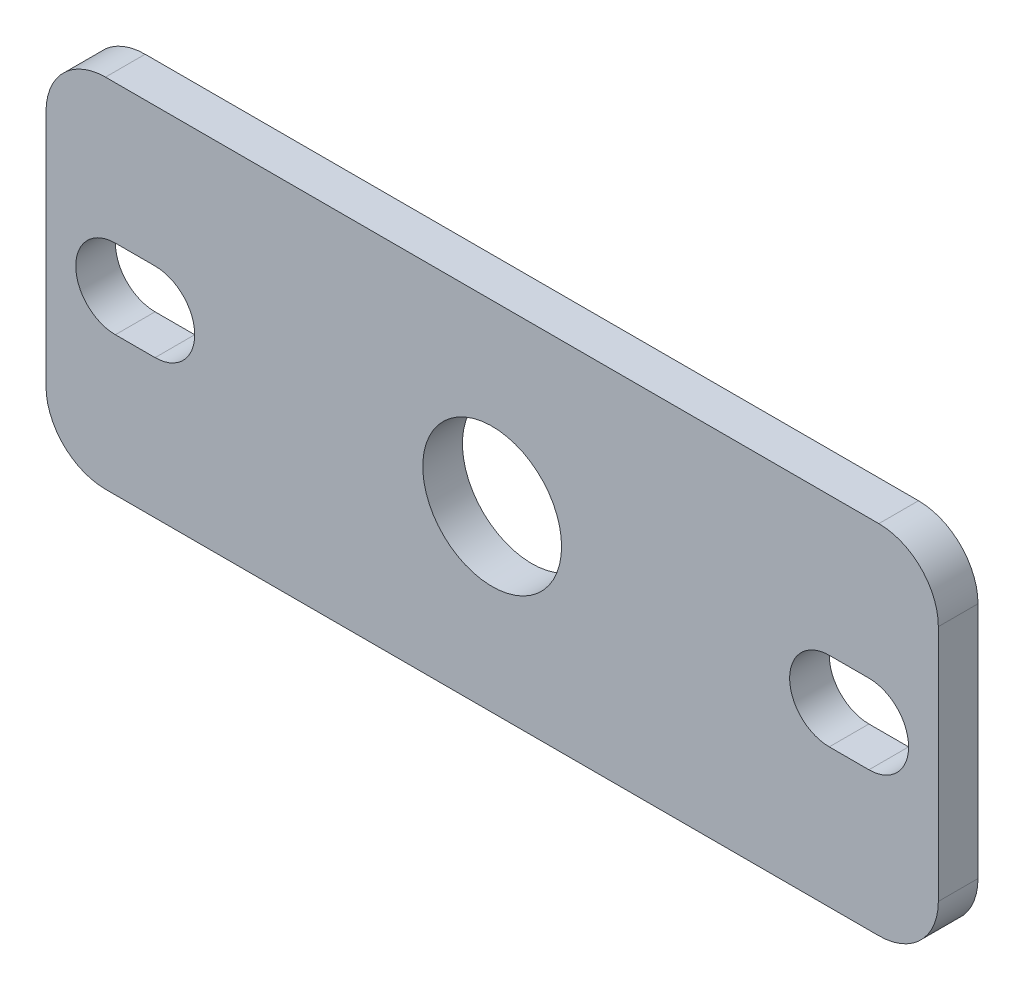
ISO-10303-21;
HEADER;
FILE_DESCRIPTION(('STEP AP214'),'2;1');
FILE_NAME('part.step','',(''),(''),'','','');
FILE_SCHEMA(('AUTOMOTIVE_DESIGN { 1 0 10303 214 1 1 1 1 }'));
ENDSEC;
DATA;
#1=APPLICATION_CONTEXT('core data for automotive mechanical design processes');
#2=APPLICATION_PROTOCOL_DEFINITION('international standard','automotive_design',2000,#1);
#3=PRODUCT_CONTEXT('',#1,'mechanical');
#4=PRODUCT('Part','Part','',(#3));
#5=PRODUCT_RELATED_PRODUCT_CATEGORY('part','',(#4));
#6=PRODUCT_DEFINITION_FORMATION('','',#4);
#7=PRODUCT_DEFINITION_CONTEXT('part definition',#1,'design');
#8=PRODUCT_DEFINITION('design','',#6,#7);
#9=PRODUCT_DEFINITION_SHAPE('','',#8);
#10=(LENGTH_UNIT() NAMED_UNIT(*) SI_UNIT(.MILLI.,.METRE.));
#11=(NAMED_UNIT(*) PLANE_ANGLE_UNIT() SI_UNIT($,.RADIAN.));
#12=(NAMED_UNIT(*) SI_UNIT($,.STERADIAN.) SOLID_ANGLE_UNIT());
#13=UNCERTAINTY_MEASURE_WITH_UNIT(LENGTH_MEASURE(1.E-05),#10,'distance_accuracy_value','');
#14=(GEOMETRIC_REPRESENTATION_CONTEXT(3) GLOBAL_UNCERTAINTY_ASSIGNED_CONTEXT((#13)) GLOBAL_UNIT_ASSIGNED_CONTEXT((#10,
#11,#12)) REPRESENTATION_CONTEXT('',''));
#15=CARTESIAN_POINT('',(0.,0.,0.));
#16=DIRECTION('',(0.,0.,1.));
#17=DIRECTION('',(1.,0.,0.));
#18=AXIS2_PLACEMENT_3D('',#15,#16,#17);
#19=CARTESIAN_POINT('',(-22.5,9.,2.));
#20=DIRECTION('',(1.,0.,0.));
#21=DIRECTION('',(0.,0.,-1.));
#22=AXIS2_PLACEMENT_3D('',#19,#20,#21);
#23=PLANE('',#22);
#24=DIRECTION('',(0.,-1.,0.));
#25=VECTOR('',#24,1.);
#26=CARTESIAN_POINT('',(-22.5,9.,0.));
#27=LINE('',#26,#25);
#28=CARTESIAN_POINT('',(-22.5,6.,0.));
#29=VERTEX_POINT('',#28);
#30=CARTESIAN_POINT('',(-22.5,-6.,0.));
#31=VERTEX_POINT('',#30);
#32=EDGE_CURVE('E214',#29,#31,#27,.T.);
#33=ORIENTED_EDGE('',*,*,#32,.T.);
#34=DIRECTION('',(0.,0.,-1.));
#35=VECTOR('',#34,1.);
#36=CARTESIAN_POINT('',(-22.5,-6.,2.));
#37=LINE('',#36,#35);
#38=CARTESIAN_POINT('',(-22.5,-6.,2.));
#39=VERTEX_POINT('',#38);
#40=EDGE_CURVE('E267',#31,#39,#37,.F.);
#41=ORIENTED_EDGE('',*,*,#40,.T.);
#42=DIRECTION('',(0.,-1.,0.));
#43=VECTOR('',#42,1.);
#44=CARTESIAN_POINT('',(-22.5,9.,2.));
#45=LINE('',#44,#43);
#46=CARTESIAN_POINT('',(-22.5,6.,2.));
#47=VERTEX_POINT('',#46);
#48=EDGE_CURVE('E215',#47,#39,#45,.T.);
#49=ORIENTED_EDGE('',*,*,#48,.F.);
#50=DIRECTION('',(0.,0.,-1.));
#51=VECTOR('',#50,1.);
#52=CARTESIAN_POINT('',(-22.5,6.,2.));
#53=LINE('',#52,#51);
#54=EDGE_CURVE('E264',#47,#29,#53,.T.);
#55=ORIENTED_EDGE('',*,*,#54,.T.);
#56=EDGE_LOOP('',(#33,#41,#49,#55));
#57=FACE_BOUND('',#56,.T.);
#58=ADVANCED_FACE('F34',(#57),#23,.F.);
#59=CARTESIAN_POINT('',(-22.5,-9.,2.));
#60=DIRECTION('',(0.,1.,0.));
#61=DIRECTION('',(0.,0.,1.));
#62=AXIS2_PLACEMENT_3D('',#59,#60,#61);
#63=PLANE('',#62);
#64=DIRECTION('',(1.,0.,0.));
#65=VECTOR('',#64,1.);
#66=CARTESIAN_POINT('',(-22.5,-9.,0.));
#67=LINE('',#66,#65);
#68=CARTESIAN_POINT('',(-19.5,-9.,0.));
#69=VERTEX_POINT('',#68);
#70=CARTESIAN_POINT('',(19.5,-9.,0.));
#71=VERTEX_POINT('',#70);
#72=EDGE_CURVE('E231',#69,#71,#67,.T.);
#73=ORIENTED_EDGE('',*,*,#72,.T.);
#74=DIRECTION('',(0.,0.,-1.));
#75=VECTOR('',#74,1.);
#76=CARTESIAN_POINT('',(19.5,-9.,2.));
#77=LINE('',#76,#75);
#78=CARTESIAN_POINT('',(19.5,-9.,2.));
#79=VERTEX_POINT('',#78);
#80=EDGE_CURVE('E254',#71,#79,#77,.F.);
#81=ORIENTED_EDGE('',*,*,#80,.T.);
#82=DIRECTION('',(1.,0.,0.));
#83=VECTOR('',#82,1.);
#84=CARTESIAN_POINT('',(-22.5,-9.,2.));
#85=LINE('',#84,#83);
#86=CARTESIAN_POINT('',(-19.5,-9.,2.));
#87=VERTEX_POINT('',#86);
#88=EDGE_CURVE('E218',#87,#79,#85,.T.);
#89=ORIENTED_EDGE('',*,*,#88,.F.);
#90=DIRECTION('',(0.,0.,-1.));
#91=VECTOR('',#90,1.);
#92=CARTESIAN_POINT('',(-19.5,-9.,2.));
#93=LINE('',#92,#91);
#94=EDGE_CURVE('E251',#87,#69,#93,.T.);
#95=ORIENTED_EDGE('',*,*,#94,.T.);
#96=EDGE_LOOP('',(#73,#81,#89,#95));
#97=FACE_BOUND('',#96,.T.);
#98=ADVANCED_FACE('F293',(#97),#63,.F.);
#99=CARTESIAN_POINT('',(22.5,9.,2.));
#100=DIRECTION('',(-1.,0.,0.));
#101=DIRECTION('',(0.,0.,1.));
#102=AXIS2_PLACEMENT_3D('',#99,#100,#101);
#103=PLANE('',#102);
#104=DIRECTION('',(0.,1.,0.));
#105=VECTOR('',#104,1.);
#106=CARTESIAN_POINT('',(22.5,9.,2.));
#107=LINE('',#106,#105);
#108=CARTESIAN_POINT('',(22.5,-6.,2.));
#109=VERTEX_POINT('',#108);
#110=CARTESIAN_POINT('',(22.5,6.,2.));
#111=VERTEX_POINT('',#110);
#112=EDGE_CURVE('E222',#109,#111,#107,.T.);
#113=ORIENTED_EDGE('',*,*,#112,.F.);
#114=DIRECTION('',(0.,0.,-1.));
#115=VECTOR('',#114,1.);
#116=CARTESIAN_POINT('',(22.5,-6.,2.));
#117=LINE('',#116,#115);
#118=CARTESIAN_POINT('',(22.5,-6.,0.));
#119=VERTEX_POINT('',#118);
#120=EDGE_CURVE('E240',#109,#119,#117,.T.);
#121=ORIENTED_EDGE('',*,*,#120,.T.);
#122=DIRECTION('',(0.,1.,0.));
#123=VECTOR('',#122,1.);
#124=CARTESIAN_POINT('',(22.5,9.,0.));
#125=LINE('',#124,#123);
#126=CARTESIAN_POINT('',(22.5,6.,0.));
#127=VERTEX_POINT('',#126);
#128=EDGE_CURVE('E234',#119,#127,#125,.T.);
#129=ORIENTED_EDGE('',*,*,#128,.T.);
#130=DIRECTION('',(0.,0.,-1.));
#131=VECTOR('',#130,1.);
#132=CARTESIAN_POINT('',(22.5,6.,2.));
#133=LINE('',#132,#131);
#134=EDGE_CURVE('E228',#127,#111,#133,.F.);
#135=ORIENTED_EDGE('',*,*,#134,.T.);
#136=EDGE_LOOP('',(#113,#121,#129,#135));
#137=FACE_BOUND('',#136,.T.);
#138=ADVANCED_FACE('F301',(#137),#103,.F.);
#139=CARTESIAN_POINT('',(-22.5,9.,2.));
#140=DIRECTION('',(0.,-1.,0.));
#141=DIRECTION('',(0.,0.,-1.));
#142=AXIS2_PLACEMENT_3D('',#139,#140,#141);
#143=PLANE('',#142);
#144=DIRECTION('',(-1.,0.,0.));
#145=VECTOR('',#144,1.);
#146=CARTESIAN_POINT('',(-22.5,9.,2.));
#147=LINE('',#146,#145);
#148=CARTESIAN_POINT('',(19.5,9.,2.));
#149=VERTEX_POINT('',#148);
#150=CARTESIAN_POINT('',(-19.5,9.,2.));
#151=VERTEX_POINT('',#150);
#152=EDGE_CURVE('E225',#149,#151,#147,.T.);
#153=ORIENTED_EDGE('',*,*,#152,.F.);
#154=DIRECTION('',(0.,0.,-1.));
#155=VECTOR('',#154,1.);
#156=CARTESIAN_POINT('',(19.5,9.,2.));
#157=LINE('',#156,#155);
#158=CARTESIAN_POINT('',(19.5,9.,0.));
#159=VERTEX_POINT('',#158);
#160=EDGE_CURVE('E11',#149,#159,#157,.T.);
#161=ORIENTED_EDGE('',*,*,#160,.T.);
#162=DIRECTION('',(-1.,0.,0.));
#163=VECTOR('',#162,1.);
#164=CARTESIAN_POINT('',(-22.5,9.,0.));
#165=LINE('',#164,#163);
#166=CARTESIAN_POINT('',(-19.5,9.,0.));
#167=VERTEX_POINT('',#166);
#168=EDGE_CURVE('E219',#159,#167,#165,.T.);
#169=ORIENTED_EDGE('',*,*,#168,.T.);
#170=DIRECTION('',(0.,0.,-1.));
#171=VECTOR('',#170,1.);
#172=CARTESIAN_POINT('',(-19.5,9.,2.));
#173=LINE('',#172,#171);
#174=EDGE_CURVE('E42',#167,#151,#173,.F.);
#175=ORIENTED_EDGE('',*,*,#174,.T.);
#176=EDGE_LOOP('',(#153,#161,#169,#175));
#177=FACE_BOUND('',#176,.T.);
#178=ADVANCED_FACE('F271',(#177),#143,.F.);
#179=CARTESIAN_POINT('',(-22.5,-9.,2.));
#180=DIRECTION('',(0.,0.,1.));
#181=DIRECTION('',(1.,0.,0.));
#182=AXIS2_PLACEMENT_3D('',#179,#180,#181);
#183=PLANE('',#182);
#184=CARTESIAN_POINT('',(0.,0.,2.));
#185=DIRECTION('',(0.,0.,1.));
#186=DIRECTION('',(1.,0.,0.));
#187=AXIS2_PLACEMENT_3D('',#184,#185,#186);
#188=CIRCLE('',#187,3.5);
#189=CARTESIAN_POINT('',(3.5,0.,2.));
#190=VERTEX_POINT('',#189);
#191=EDGE_CURVE('E479',#190,#190,#188,.T.);
#192=ORIENTED_EDGE('',*,*,#191,.F.);
#193=EDGE_LOOP('',(#192));
#194=FACE_BOUND('',#193,.T.);
#195=CARTESIAN_POINT('',(-17.,0.,2.));
#196=DIRECTION('',(0.,0.,1.));
#197=DIRECTION('',(1.,0.,0.));
#198=AXIS2_PLACEMENT_3D('',#195,#196,#197);
#199=CIRCLE('',#198,2.);
#200=CARTESIAN_POINT('',(-17.,-2.,2.));
#201=VERTEX_POINT('',#200);
#202=CARTESIAN_POINT('',(-17.,2.,2.));
#203=VERTEX_POINT('',#202);
#204=EDGE_CURVE('E49',#201,#203,#199,.T.);
#205=ORIENTED_EDGE('',*,*,#204,.F.);
#206=DIRECTION('',(1.,0.,0.));
#207=VECTOR('',#206,1.);
#208=CARTESIAN_POINT('',(-19.,-2.,2.));
#209=LINE('',#208,#207);
#210=CARTESIAN_POINT('',(-19.,-2.,2.));
#211=VERTEX_POINT('',#210);
#212=EDGE_CURVE('E155',#211,#201,#209,.T.);
#213=ORIENTED_EDGE('',*,*,#212,.F.);
#214=CARTESIAN_POINT('',(-19.,0.,2.));
#215=DIRECTION('',(0.,0.,1.));
#216=DIRECTION('',(-1.,0.,0.));
#217=AXIS2_PLACEMENT_3D('',#214,#215,#216);
#218=CIRCLE('',#217,2.);
#219=CARTESIAN_POINT('',(-19.,2.,2.));
#220=VERTEX_POINT('',#219);
#221=EDGE_CURVE('E175',#220,#211,#218,.T.);
#222=ORIENTED_EDGE('',*,*,#221,.F.);
#223=DIRECTION('',(-1.,0.,0.));
#224=VECTOR('',#223,1.);
#225=CARTESIAN_POINT('',(-17.,2.,2.));
#226=LINE('',#225,#224);
#227=EDGE_CURVE('E169',#203,#220,#226,.T.);
#228=ORIENTED_EDGE('',*,*,#227,.F.);
#229=EDGE_LOOP('',(#205,#213,#222,#228));
#230=FACE_BOUND('',#229,.T.);
#231=CARTESIAN_POINT('',(17.,0.,2.));
#232=DIRECTION('',(0.,0.,1.));
#233=DIRECTION('',(-1.,0.,0.));
#234=AXIS2_PLACEMENT_3D('',#231,#232,#233);
#235=CIRCLE('',#234,2.);
#236=CARTESIAN_POINT('',(17.,2.,2.));
#237=VERTEX_POINT('',#236);
#238=CARTESIAN_POINT('',(17.,-2.,2.));
#239=VERTEX_POINT('',#238);
#240=EDGE_CURVE('E191',#237,#239,#235,.T.);
#241=ORIENTED_EDGE('',*,*,#240,.F.);
#242=DIRECTION('',(-1.,0.,0.));
#243=VECTOR('',#242,1.);
#244=CARTESIAN_POINT('',(17.,2.,2.));
#245=LINE('',#244,#243);
#246=CARTESIAN_POINT('',(19.,2.,2.));
#247=VERTEX_POINT('',#246);
#248=EDGE_CURVE('E199',#247,#237,#245,.T.);
#249=ORIENTED_EDGE('',*,*,#248,.F.);
#250=CARTESIAN_POINT('',(19.,0.,2.));
#251=DIRECTION('',(0.,0.,1.));
#252=DIRECTION('',(1.,0.,0.));
#253=AXIS2_PLACEMENT_3D('',#250,#251,#252);
#254=CIRCLE('',#253,2.);
#255=CARTESIAN_POINT('',(19.,-2.,2.));
#256=VERTEX_POINT('',#255);
#257=EDGE_CURVE('E196',#256,#247,#254,.T.);
#258=ORIENTED_EDGE('',*,*,#257,.F.);
#259=DIRECTION('',(1.,0.,0.));
#260=VECTOR('',#259,1.);
#261=CARTESIAN_POINT('',(19.,-2.,2.));
#262=LINE('',#261,#260);
#263=EDGE_CURVE('E193',#239,#256,#262,.T.);
#264=ORIENTED_EDGE('',*,*,#263,.F.);
#265=EDGE_LOOP('',(#241,#249,#258,#264));
#266=FACE_BOUND('',#265,.T.);
#267=ORIENTED_EDGE('',*,*,#88,.T.);
#268=CARTESIAN_POINT('',(19.5,-6.,2.));
#269=DIRECTION('',(0.,0.,1.));
#270=DIRECTION('',(1.,0.,0.));
#271=AXIS2_PLACEMENT_3D('',#268,#269,#270);
#272=CIRCLE('',#271,3.);
#273=EDGE_CURVE('E262',#79,#109,#272,.T.);
#274=ORIENTED_EDGE('',*,*,#273,.T.);
#275=ORIENTED_EDGE('',*,*,#112,.T.);
#276=CARTESIAN_POINT('',(19.5,6.,2.));
#277=DIRECTION('',(0.,0.,1.));
#278=DIRECTION('',(1.,0.,0.));
#279=AXIS2_PLACEMENT_3D('',#276,#277,#278);
#280=CIRCLE('',#279,3.);
#281=EDGE_CURVE('E258',#111,#149,#280,.T.);
#282=ORIENTED_EDGE('',*,*,#281,.T.);
#283=ORIENTED_EDGE('',*,*,#152,.T.);
#284=CARTESIAN_POINT('',(-19.5,6.,2.));
#285=DIRECTION('',(0.,0.,1.));
#286=DIRECTION('',(1.,0.,0.));
#287=AXIS2_PLACEMENT_3D('',#284,#285,#286);
#288=CIRCLE('',#287,3.);
#289=EDGE_CURVE('E256',#151,#47,#288,.T.);
#290=ORIENTED_EDGE('',*,*,#289,.T.);
#291=ORIENTED_EDGE('',*,*,#48,.T.);
#292=CARTESIAN_POINT('',(-19.5,-6.,2.));
#293=DIRECTION('',(0.,0.,1.));
#294=DIRECTION('',(1.,0.,0.));
#295=AXIS2_PLACEMENT_3D('',#292,#293,#294);
#296=CIRCLE('',#295,3.);
#297=EDGE_CURVE('E260',#39,#87,#296,.T.);
#298=ORIENTED_EDGE('',*,*,#297,.T.);
#299=EDGE_LOOP('',(#267,#274,#275,#282,#283,#290,#291,#298));
#300=FACE_BOUND('',#299,.T.);
#301=ADVANCED_FACE('F277',(#194,#230,#266,#300),#183,.T.);
#302=CARTESIAN_POINT('',(-22.5,-9.,0.));
#303=DIRECTION('',(0.,0.,1.));
#304=DIRECTION('',(1.,0.,0.));
#305=AXIS2_PLACEMENT_3D('',#302,#303,#304);
#306=PLANE('',#305);
#307=CARTESIAN_POINT('',(0.,0.,0.));
#308=DIRECTION('',(0.,0.,1.));
#309=DIRECTION('',(1.,0.,0.));
#310=AXIS2_PLACEMENT_3D('',#307,#308,#309);
#311=CIRCLE('',#310,3.5);
#312=CARTESIAN_POINT('',(3.5,0.,0.));
#313=VERTEX_POINT('',#312);
#314=EDGE_CURVE('E477',#313,#313,#311,.F.);
#315=ORIENTED_EDGE('',*,*,#314,.F.);
#316=EDGE_LOOP('',(#315));
#317=FACE_BOUND('',#316,.T.);
#318=DIRECTION('',(-1.,0.,0.));
#319=VECTOR('',#318,1.);
#320=CARTESIAN_POINT('',(-19.,-2.,0.));
#321=LINE('',#320,#319);
#322=CARTESIAN_POINT('',(-17.,-2.,0.));
#323=VERTEX_POINT('',#322);
#324=CARTESIAN_POINT('',(-19.,-2.,0.));
#325=VERTEX_POINT('',#324);
#326=EDGE_CURVE('E167',#323,#325,#321,.T.);
#327=ORIENTED_EDGE('',*,*,#326,.F.);
#328=CARTESIAN_POINT('',(-17.,0.,0.));
#329=DIRECTION('',(0.,0.,1.));
#330=DIRECTION('',(1.,0.,0.));
#331=AXIS2_PLACEMENT_3D('',#328,#329,#330);
#332=CIRCLE('',#331,2.);
#333=CARTESIAN_POINT('',(-17.,2.,0.));
#334=VERTEX_POINT('',#333);
#335=EDGE_CURVE('E149',#334,#323,#332,.F.);
#336=ORIENTED_EDGE('',*,*,#335,.F.);
#337=DIRECTION('',(1.,0.,0.));
#338=VECTOR('',#337,1.);
#339=CARTESIAN_POINT('',(-17.,2.,0.));
#340=LINE('',#339,#338);
#341=CARTESIAN_POINT('',(-19.,2.,0.));
#342=VERTEX_POINT('',#341);
#343=EDGE_CURVE('E158',#342,#334,#340,.T.);
#344=ORIENTED_EDGE('',*,*,#343,.F.);
#345=CARTESIAN_POINT('',(-19.,0.,0.));
#346=DIRECTION('',(0.,0.,1.));
#347=DIRECTION('',(1.,0.,0.));
#348=AXIS2_PLACEMENT_3D('',#345,#346,#347);
#349=CIRCLE('',#348,2.);
#350=EDGE_CURVE('E57',#325,#342,#349,.F.);
#351=ORIENTED_EDGE('',*,*,#350,.F.);
#352=EDGE_LOOP('',(#327,#336,#344,#351));
#353=FACE_BOUND('',#352,.T.);
#354=DIRECTION('',(1.,0.,0.));
#355=VECTOR('',#354,1.);
#356=CARTESIAN_POINT('',(17.,2.,0.));
#357=LINE('',#356,#355);
#358=CARTESIAN_POINT('',(17.,2.,0.));
#359=VERTEX_POINT('',#358);
#360=CARTESIAN_POINT('',(19.,2.,0.));
#361=VERTEX_POINT('',#360);
#362=EDGE_CURVE('E185',#359,#361,#357,.T.);
#363=ORIENTED_EDGE('',*,*,#362,.F.);
#364=CARTESIAN_POINT('',(17.,0.,0.));
#365=DIRECTION('',(0.,0.,1.));
#366=DIRECTION('',(1.,0.,0.));
#367=AXIS2_PLACEMENT_3D('',#364,#365,#366);
#368=CIRCLE('',#367,2.);
#369=CARTESIAN_POINT('',(17.,-2.,0.));
#370=VERTEX_POINT('',#369);
#371=EDGE_CURVE('E188',#370,#359,#368,.F.);
#372=ORIENTED_EDGE('',*,*,#371,.F.);
#373=DIRECTION('',(-1.,0.,0.));
#374=VECTOR('',#373,1.);
#375=CARTESIAN_POINT('',(19.,-2.,0.));
#376=LINE('',#375,#374);
#377=CARTESIAN_POINT('',(19.,-2.,0.));
#378=VERTEX_POINT('',#377);
#379=EDGE_CURVE('E205',#378,#370,#376,.T.);
#380=ORIENTED_EDGE('',*,*,#379,.F.);
#381=CARTESIAN_POINT('',(19.,0.,0.));
#382=DIRECTION('',(0.,0.,1.));
#383=DIRECTION('',(1.,0.,0.));
#384=AXIS2_PLACEMENT_3D('',#381,#382,#383);
#385=CIRCLE('',#384,2.);
#386=EDGE_CURVE('E161',#361,#378,#385,.F.);
#387=ORIENTED_EDGE('',*,*,#386,.F.);
#388=EDGE_LOOP('',(#363,#372,#380,#387));
#389=FACE_BOUND('',#388,.T.);
#390=ORIENTED_EDGE('',*,*,#128,.F.);
#391=CARTESIAN_POINT('',(19.5,-6.,0.));
#392=DIRECTION('',(0.,0.,1.));
#393=DIRECTION('',(1.,0.,0.));
#394=AXIS2_PLACEMENT_3D('',#391,#392,#393);
#395=CIRCLE('',#394,3.);
#396=EDGE_CURVE('E249',#119,#71,#395,.F.);
#397=ORIENTED_EDGE('',*,*,#396,.T.);
#398=ORIENTED_EDGE('',*,*,#72,.F.);
#399=CARTESIAN_POINT('',(-19.5,-6.,0.));
#400=DIRECTION('',(0.,0.,1.));
#401=DIRECTION('',(1.,0.,0.));
#402=AXIS2_PLACEMENT_3D('',#399,#400,#401);
#403=CIRCLE('',#402,3.);
#404=EDGE_CURVE('E247',#69,#31,#403,.F.);
#405=ORIENTED_EDGE('',*,*,#404,.T.);
#406=ORIENTED_EDGE('',*,*,#32,.F.);
#407=CARTESIAN_POINT('',(-19.5,6.,0.));
#408=DIRECTION('',(0.,0.,1.));
#409=DIRECTION('',(1.,0.,0.));
#410=AXIS2_PLACEMENT_3D('',#407,#408,#409);
#411=CIRCLE('',#410,3.);
#412=EDGE_CURVE('E243',#29,#167,#411,.F.);
#413=ORIENTED_EDGE('',*,*,#412,.T.);
#414=ORIENTED_EDGE('',*,*,#168,.F.);
#415=CARTESIAN_POINT('',(19.5,6.,0.));
#416=DIRECTION('',(0.,0.,1.));
#417=DIRECTION('',(1.,0.,0.));
#418=AXIS2_PLACEMENT_3D('',#415,#416,#417);
#419=CIRCLE('',#418,3.);
#420=EDGE_CURVE('E245',#159,#127,#419,.F.);
#421=ORIENTED_EDGE('',*,*,#420,.T.);
#422=EDGE_LOOP('',(#390,#397,#398,#405,#406,#413,#414,#421));
#423=FACE_BOUND('',#422,.T.);
#424=ADVANCED_FACE('F164',(#317,#353,#389,#423),#306,.F.);
#425=CARTESIAN_POINT('',(19.5,-6.,2.));
#426=DIRECTION('',(0.,0.,-1.));
#427=DIRECTION('',(-1.,0.,0.));
#428=AXIS2_PLACEMENT_3D('',#425,#426,#427);
#429=CYLINDRICAL_SURFACE('',#428,3.);
#430=ORIENTED_EDGE('',*,*,#273,.F.);
#431=ORIENTED_EDGE('',*,*,#80,.F.);
#432=ORIENTED_EDGE('',*,*,#396,.F.);
#433=ORIENTED_EDGE('',*,*,#120,.F.);
#434=EDGE_LOOP('',(#430,#431,#432,#433));
#435=FACE_BOUND('',#434,.T.);
#436=ADVANCED_FACE('F299',(#435),#429,.T.);
#437=CARTESIAN_POINT('',(-19.5,-6.,2.));
#438=DIRECTION('',(0.,0.,-1.));
#439=DIRECTION('',(-1.,0.,0.));
#440=AXIS2_PLACEMENT_3D('',#437,#438,#439);
#441=CYLINDRICAL_SURFACE('',#440,3.);
#442=ORIENTED_EDGE('',*,*,#297,.F.);
#443=ORIENTED_EDGE('',*,*,#40,.F.);
#444=ORIENTED_EDGE('',*,*,#404,.F.);
#445=ORIENTED_EDGE('',*,*,#94,.F.);
#446=EDGE_LOOP('',(#442,#443,#444,#445));
#447=FACE_BOUND('',#446,.T.);
#448=ADVANCED_FACE('F290',(#447),#441,.T.);
#449=CARTESIAN_POINT('',(19.5,6.,2.));
#450=DIRECTION('',(0.,0.,-1.));
#451=DIRECTION('',(-1.,0.,0.));
#452=AXIS2_PLACEMENT_3D('',#449,#450,#451);
#453=CYLINDRICAL_SURFACE('',#452,3.);
#454=ORIENTED_EDGE('',*,*,#281,.F.);
#455=ORIENTED_EDGE('',*,*,#134,.F.);
#456=ORIENTED_EDGE('',*,*,#420,.F.);
#457=ORIENTED_EDGE('',*,*,#160,.F.);
#458=EDGE_LOOP('',(#454,#455,#456,#457));
#459=FACE_BOUND('',#458,.T.);
#460=ADVANCED_FACE('F304',(#459),#453,.T.);
#461=CARTESIAN_POINT('',(-19.5,6.,2.));
#462=DIRECTION('',(0.,0.,-1.));
#463=DIRECTION('',(-1.,0.,0.));
#464=AXIS2_PLACEMENT_3D('',#461,#462,#463);
#465=CYLINDRICAL_SURFACE('',#464,3.);
#466=ORIENTED_EDGE('',*,*,#289,.F.);
#467=ORIENTED_EDGE('',*,*,#174,.F.);
#468=ORIENTED_EDGE('',*,*,#412,.F.);
#469=ORIENTED_EDGE('',*,*,#54,.F.);
#470=EDGE_LOOP('',(#466,#467,#468,#469));
#471=FACE_BOUND('',#470,.T.);
#472=ADVANCED_FACE('F36',(#471),#465,.T.);
#473=CARTESIAN_POINT('',(17.,0.,-0.00100000000000013));
#474=DIRECTION('',(0.,0.,1.));
#475=DIRECTION('',(1.,0.,0.));
#476=AXIS2_PLACEMENT_3D('',#473,#474,#475);
#477=CYLINDRICAL_SURFACE('',#476,2.);
#478=ORIENTED_EDGE('',*,*,#371,.T.);
#479=DIRECTION('',(0.,0.,1.));
#480=VECTOR('',#479,1.);
#481=CARTESIAN_POINT('',(17.,2.,-0.00100000000000013));
#482=LINE('',#481,#480);
#483=EDGE_CURVE('E203',#359,#237,#482,.T.);
#484=ORIENTED_EDGE('',*,*,#483,.T.);
#485=ORIENTED_EDGE('',*,*,#240,.T.);
#486=DIRECTION('',(0.,0.,1.));
#487=VECTOR('',#486,1.);
#488=CARTESIAN_POINT('',(17.,-2.,-0.00100000000000013));
#489=LINE('',#488,#487);
#490=EDGE_CURVE('E202',#370,#239,#489,.T.);
#491=ORIENTED_EDGE('',*,*,#490,.F.);
#492=EDGE_LOOP('',(#478,#484,#485,#491));
#493=FACE_BOUND('',#492,.T.);
#494=ADVANCED_FACE('F310',(#493),#477,.F.);
#495=CARTESIAN_POINT('',(17.,2.,-0.00100000000000013));
#496=DIRECTION('',(0.,1.,0.));
#497=DIRECTION('',(-1.,0.,0.));
#498=AXIS2_PLACEMENT_3D('',#495,#496,#497);
#499=PLANE('',#498);
#500=ORIENTED_EDGE('',*,*,#362,.T.);
#501=DIRECTION('',(0.,0.,1.));
#502=VECTOR('',#501,1.);
#503=CARTESIAN_POINT('',(19.,2.,-0.00100000000000013));
#504=LINE('',#503,#502);
#505=EDGE_CURVE('E206',#361,#247,#504,.T.);
#506=ORIENTED_EDGE('',*,*,#505,.T.);
#507=ORIENTED_EDGE('',*,*,#248,.T.);
#508=ORIENTED_EDGE('',*,*,#483,.F.);
#509=EDGE_LOOP('',(#500,#506,#507,#508));
#510=FACE_BOUND('',#509,.T.);
#511=ADVANCED_FACE('F366',(#510),#499,.F.);
#512=CARTESIAN_POINT('',(19.,0.,-0.00100000000000013));
#513=DIRECTION('',(0.,0.,1.));
#514=DIRECTION('',(1.,0.,0.));
#515=AXIS2_PLACEMENT_3D('',#512,#513,#514);
#516=CYLINDRICAL_SURFACE('',#515,2.);
#517=ORIENTED_EDGE('',*,*,#386,.T.);
#518=DIRECTION('',(0.,0.,1.));
#519=VECTOR('',#518,1.);
#520=CARTESIAN_POINT('',(19.,-2.,-0.00100000000000013));
#521=LINE('',#520,#519);
#522=EDGE_CURVE('E208',#378,#256,#521,.T.);
#523=ORIENTED_EDGE('',*,*,#522,.T.);
#524=ORIENTED_EDGE('',*,*,#257,.T.);
#525=ORIENTED_EDGE('',*,*,#505,.F.);
#526=EDGE_LOOP('',(#517,#523,#524,#525));
#527=FACE_BOUND('',#526,.T.);
#528=ADVANCED_FACE('F360',(#527),#516,.F.);
#529=CARTESIAN_POINT('',(19.,-2.,-0.00100000000000013));
#530=DIRECTION('',(0.,-1.,0.));
#531=DIRECTION('',(1.,0.,0.));
#532=AXIS2_PLACEMENT_3D('',#529,#530,#531);
#533=PLANE('',#532);
#534=ORIENTED_EDGE('',*,*,#379,.T.);
#535=ORIENTED_EDGE('',*,*,#490,.T.);
#536=ORIENTED_EDGE('',*,*,#263,.T.);
#537=ORIENTED_EDGE('',*,*,#522,.F.);
#538=EDGE_LOOP('',(#534,#535,#536,#537));
#539=FACE_BOUND('',#538,.T.);
#540=ADVANCED_FACE('F365',(#539),#533,.F.);
#541=CARTESIAN_POINT('',(-17.,0.,-0.00100000000000013));
#542=DIRECTION('',(0.,0.,1.));
#543=DIRECTION('',(1.,0.,0.));
#544=AXIS2_PLACEMENT_3D('',#541,#542,#543);
#545=CYLINDRICAL_SURFACE('',#544,2.);
#546=ORIENTED_EDGE('',*,*,#335,.T.);
#547=DIRECTION('',(0.,0.,1.));
#548=VECTOR('',#547,1.);
#549=CARTESIAN_POINT('',(-17.,-2.,-0.00100000000000013));
#550=LINE('',#549,#548);
#551=EDGE_CURVE('E162',#323,#201,#550,.T.);
#552=ORIENTED_EDGE('',*,*,#551,.T.);
#553=ORIENTED_EDGE('',*,*,#204,.T.);
#554=DIRECTION('',(0.,0.,1.));
#555=VECTOR('',#554,1.);
#556=CARTESIAN_POINT('',(-17.,2.,-0.00100000000000013));
#557=LINE('',#556,#555);
#558=EDGE_CURVE('E145',#334,#203,#557,.T.);
#559=ORIENTED_EDGE('',*,*,#558,.F.);
#560=EDGE_LOOP('',(#546,#552,#553,#559));
#561=FACE_BOUND('',#560,.T.);
#562=ADVANCED_FACE('F147',(#561),#545,.F.);
#563=CARTESIAN_POINT('',(-19.,-2.,-0.00100000000000013));
#564=DIRECTION('',(0.,-1.,0.));
#565=DIRECTION('',(1.,0.,0.));
#566=AXIS2_PLACEMENT_3D('',#563,#564,#565);
#567=PLANE('',#566);
#568=ORIENTED_EDGE('',*,*,#326,.T.);
#569=DIRECTION('',(0.,0.,1.));
#570=VECTOR('',#569,1.);
#571=CARTESIAN_POINT('',(-19.,-2.,-0.00100000000000013));
#572=LINE('',#571,#570);
#573=EDGE_CURVE('E181',#325,#211,#572,.T.);
#574=ORIENTED_EDGE('',*,*,#573,.T.);
#575=ORIENTED_EDGE('',*,*,#212,.T.);
#576=ORIENTED_EDGE('',*,*,#551,.F.);
#577=EDGE_LOOP('',(#568,#574,#575,#576));
#578=FACE_BOUND('',#577,.T.);
#579=ADVANCED_FACE('F447',(#578),#567,.F.);
#580=CARTESIAN_POINT('',(-19.,0.,-0.00100000000000013));
#581=DIRECTION('',(0.,0.,1.));
#582=DIRECTION('',(1.,0.,0.));
#583=AXIS2_PLACEMENT_3D('',#580,#581,#582);
#584=CYLINDRICAL_SURFACE('',#583,2.);
#585=ORIENTED_EDGE('',*,*,#350,.T.);
#586=DIRECTION('',(0.,0.,1.));
#587=VECTOR('',#586,1.);
#588=CARTESIAN_POINT('',(-19.,2.,-0.00100000000000013));
#589=LINE('',#588,#587);
#590=EDGE_CURVE('E154',#342,#220,#589,.T.);
#591=ORIENTED_EDGE('',*,*,#590,.T.);
#592=ORIENTED_EDGE('',*,*,#221,.T.);
#593=ORIENTED_EDGE('',*,*,#573,.F.);
#594=EDGE_LOOP('',(#585,#591,#592,#593));
#595=FACE_BOUND('',#594,.T.);
#596=ADVANCED_FACE('F455',(#595),#584,.F.);
#597=CARTESIAN_POINT('',(-17.,2.,-0.00100000000000013));
#598=DIRECTION('',(0.,1.,0.));
#599=DIRECTION('',(-1.,0.,0.));
#600=AXIS2_PLACEMENT_3D('',#597,#598,#599);
#601=PLANE('',#600);
#602=ORIENTED_EDGE('',*,*,#343,.T.);
#603=ORIENTED_EDGE('',*,*,#558,.T.);
#604=ORIENTED_EDGE('',*,*,#227,.T.);
#605=ORIENTED_EDGE('',*,*,#590,.F.);
#606=EDGE_LOOP('',(#602,#603,#604,#605));
#607=FACE_BOUND('',#606,.T.);
#608=ADVANCED_FACE('F159',(#607),#601,.F.);
#609=CARTESIAN_POINT('',(0.,0.,-0.00100000000000013));
#610=DIRECTION('',(0.,0.,1.));
#611=DIRECTION('',(1.,0.,0.));
#612=AXIS2_PLACEMENT_3D('',#609,#610,#611);
#613=CYLINDRICAL_SURFACE('',#612,3.5);
#614=ORIENTED_EDGE('',*,*,#191,.T.);
#615=EDGE_LOOP('',(#614));
#616=FACE_BOUND('',#615,.T.);
#617=ORIENTED_EDGE('',*,*,#314,.T.);
#618=EDGE_LOOP('',(#617));
#619=FACE_BOUND('',#618,.T.);
#620=ADVANCED_FACE('F376',(#616,#619),#613,.F.);
#621=CLOSED_SHELL('',(#58,#98,#138,#178,#301,#424,#436,#448,#460,#472,#494,#511,#528,#540,#562,
#579,#596,#608,#620));
#622=MANIFOLD_SOLID_BREP('B2',#621);
#623=ADVANCED_BREP_SHAPE_REPRESENTATION('',(#18,#622),#14);
#624=SHAPE_DEFINITION_REPRESENTATION(#9,#623);
ENDSEC;
END-ISO-10303-21;
